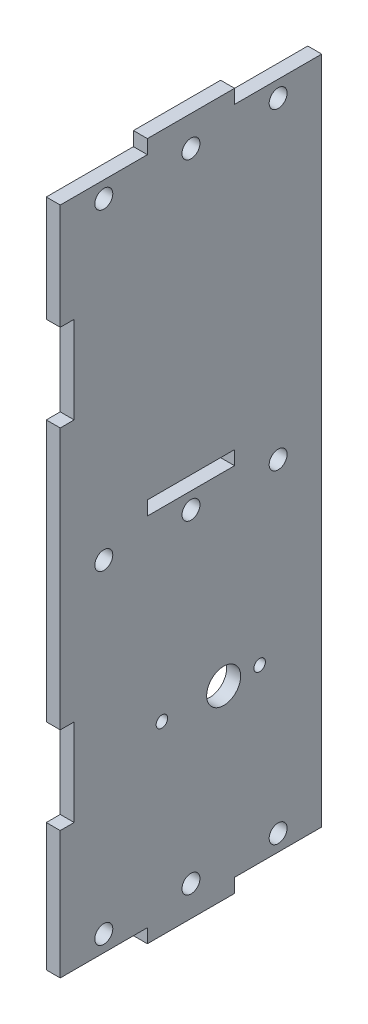
ISO-10303-21;
HEADER;
FILE_DESCRIPTION(('STEP AP214'),'2;1');
FILE_NAME('part.step','',(''),(''),'','','');
FILE_SCHEMA(('AUTOMOTIVE_DESIGN { 1 0 10303 214 1 1 1 1 }'));
ENDSEC;
DATA;
#1=APPLICATION_CONTEXT('core data for automotive mechanical design processes');
#2=APPLICATION_PROTOCOL_DEFINITION('international standard','automotive_design',2000,#1);
#3=PRODUCT_CONTEXT('',#1,'mechanical');
#4=PRODUCT('Part','Part','',(#3));
#5=PRODUCT_RELATED_PRODUCT_CATEGORY('part','',(#4));
#6=PRODUCT_DEFINITION_FORMATION('','',#4);
#7=PRODUCT_DEFINITION_CONTEXT('part definition',#1,'design');
#8=PRODUCT_DEFINITION('design','',#6,#7);
#9=PRODUCT_DEFINITION_SHAPE('','',#8);
#10=(LENGTH_UNIT() NAMED_UNIT(*) SI_UNIT(.MILLI.,.METRE.));
#11=(NAMED_UNIT(*) PLANE_ANGLE_UNIT() SI_UNIT($,.RADIAN.));
#12=(NAMED_UNIT(*) SI_UNIT($,.STERADIAN.) SOLID_ANGLE_UNIT());
#13=UNCERTAINTY_MEASURE_WITH_UNIT(LENGTH_MEASURE(1.E-05),#10,'distance_accuracy_value','');
#14=(GEOMETRIC_REPRESENTATION_CONTEXT(3) GLOBAL_UNCERTAINTY_ASSIGNED_CONTEXT((#13)) GLOBAL_UNIT_ASSIGNED_CONTEXT((#10,
#11,#12)) REPRESENTATION_CONTEXT('',''));
#15=CARTESIAN_POINT('',(0.,0.,0.));
#16=DIRECTION('',(0.,0.,1.));
#17=DIRECTION('',(1.,0.,0.));
#18=AXIS2_PLACEMENT_3D('',#15,#16,#17);
#19=CARTESIAN_POINT('',(0.,-60.3250000016129,0.));
#20=DIRECTION('',(0.,1.,0.));
#21=DIRECTION('',(0.,0.,1.));
#22=AXIS2_PLACEMENT_3D('',#19,#20,#21);
#23=PLANE('',#22);
#24=DIRECTION('',(0.,0.,-1.));
#25=VECTOR('',#24,1.);
#26=CARTESIAN_POINT('',(0.,-60.325,0.));
#27=LINE('',#26,#25);
#28=CARTESIAN_POINT('',(0.,-60.3250000004032,34.0359999994839));
#29=VERTEX_POINT('',#28);
#30=CARTESIAN_POINT('',(0.,-60.3250000004032,38.1));
#31=VERTEX_POINT('',#30);
#32=EDGE_CURVE('E338',#29,#31,#27,.F.);
#33=ORIENTED_EDGE('',*,*,#32,.T.);
#34=DIRECTION('',(1.,0.,0.));
#35=VECTOR('',#34,1.);
#36=CARTESIAN_POINT('',(0.,-60.325,38.1));
#37=LINE('',#36,#35);
#38=CARTESIAN_POINT('',(4.06399999993548,-60.3250000004032,38.1));
#39=VERTEX_POINT('',#38);
#40=EDGE_CURVE('E437',#31,#39,#37,.T.);
#41=ORIENTED_EDGE('',*,*,#40,.T.);
#42=DIRECTION('',(0.,0.,-1.));
#43=VECTOR('',#42,1.);
#44=CARTESIAN_POINT('',(4.06399999974193,-60.325,0.));
#45=LINE('',#44,#43);
#46=CARTESIAN_POINT('',(4.06399999993548,-60.3250000008064,34.0359999997419));
#47=VERTEX_POINT('',#46);
#48=EDGE_CURVE('E434',#39,#47,#45,.T.);
#49=ORIENTED_EDGE('',*,*,#48,.T.);
#50=DIRECTION('',(1.,0.,0.));
#51=VECTOR('',#50,1.);
#52=CARTESIAN_POINT('',(0.,-60.325,34.0359999989677));
#53=LINE('',#52,#51);
#54=EDGE_CURVE('E245',#47,#29,#53,.F.);
#55=ORIENTED_EDGE('',*,*,#54,.T.);
#56=EDGE_LOOP('',(#33,#41,#49,#55));
#57=FACE_BOUND('',#56,.T.);
#58=ADVANCED_FACE('F17',(#57),#23,.T.);
#59=CARTESIAN_POINT('',(0.,0.,34.0359999989677));
#60=DIRECTION('',(0.,0.,1.));
#61=DIRECTION('',(1.,0.,0.));
#62=AXIS2_PLACEMENT_3D('',#59,#60,#61);
#63=PLANE('',#62);
#64=DIRECTION('',(0.,1.,0.));
#65=VECTOR('',#64,1.);
#66=CARTESIAN_POINT('',(0.,0.,34.036));
#67=LINE('',#66,#65);
#68=CARTESIAN_POINT('',(0.,-34.9250000008065,34.0359999997419));
#69=VERTEX_POINT('',#68);
#70=EDGE_CURVE('E340',#69,#29,#67,.F.);
#71=ORIENTED_EDGE('',*,*,#70,.T.);
#72=ORIENTED_EDGE('',*,*,#54,.F.);
#73=DIRECTION('',(0.,1.,0.));
#74=VECTOR('',#73,1.);
#75=CARTESIAN_POINT('',(4.06399999974193,0.,34.036));
#76=LINE('',#75,#74);
#77=CARTESIAN_POINT('',(4.06399999993548,-34.9250000004032,34.0359999994839));
#78=VERTEX_POINT('',#77);
#79=EDGE_CURVE('E431',#47,#78,#76,.T.);
#80=ORIENTED_EDGE('',*,*,#79,.T.);
#81=DIRECTION('',(1.,0.,0.));
#82=VECTOR('',#81,1.);
#83=CARTESIAN_POINT('',(0.,-34.9250000016129,34.036));
#84=LINE('',#83,#82);
#85=EDGE_CURVE('E243',#78,#69,#84,.F.);
#86=ORIENTED_EDGE('',*,*,#85,.T.);
#87=EDGE_LOOP('',(#71,#72,#80,#86));
#88=FACE_BOUND('',#87,.T.);
#89=ADVANCED_FACE('F810',(#88),#63,.T.);
#90=CARTESIAN_POINT('',(0.,-34.9250000016129,0.));
#91=DIRECTION('',(0.,1.,0.));
#92=DIRECTION('',(0.,0.,1.));
#93=AXIS2_PLACEMENT_3D('',#90,#91,#92);
#94=PLANE('',#93);
#95=DIRECTION('',(1.,0.,0.));
#96=VECTOR('',#95,1.);
#97=CARTESIAN_POINT('',(0.,-34.925,38.1));
#98=LINE('',#97,#96);
#99=CARTESIAN_POINT('',(4.06399999993548,-34.9250000008065,38.1));
#100=VERTEX_POINT('',#99);
#101=CARTESIAN_POINT('',(0.,-34.9250000004032,38.1));
#102=VERTEX_POINT('',#101);
#103=EDGE_CURVE('E241',#100,#102,#98,.F.);
#104=ORIENTED_EDGE('',*,*,#103,.T.);
#105=DIRECTION('',(0.,0.,-1.));
#106=VECTOR('',#105,1.);
#107=CARTESIAN_POINT('',(0.,-34.925,0.));
#108=LINE('',#107,#106);
#109=EDGE_CURVE('E343',#102,#69,#108,.T.);
#110=ORIENTED_EDGE('',*,*,#109,.T.);
#111=ORIENTED_EDGE('',*,*,#85,.F.);
#112=DIRECTION('',(0.,0.,-1.));
#113=VECTOR('',#112,1.);
#114=CARTESIAN_POINT('',(4.06399999974193,-34.925,0.));
#115=LINE('',#114,#113);
#116=EDGE_CURVE('E428',#78,#100,#115,.F.);
#117=ORIENTED_EDGE('',*,*,#116,.T.);
#118=EDGE_LOOP('',(#104,#110,#111,#117));
#119=FACE_BOUND('',#118,.T.);
#120=ADVANCED_FACE('F801',(#119),#94,.F.);
#121=CARTESIAN_POINT('',(0.,0.,38.1));
#122=DIRECTION('',(0.,0.,1.));
#123=DIRECTION('',(1.,0.,0.));
#124=AXIS2_PLACEMENT_3D('',#121,#122,#123);
#125=PLANE('',#124);
#126=DIRECTION('',(1.,0.,0.));
#127=VECTOR('',#126,1.);
#128=CARTESIAN_POINT('',(0.,41.2749999983871,38.1));
#129=LINE('',#128,#127);
#130=CARTESIAN_POINT('',(4.06399999993548,41.2749999995968,38.1));
#131=VERTEX_POINT('',#130);
#132=CARTESIAN_POINT('',(0.,41.2749999991936,38.1));
#133=VERTEX_POINT('',#132);
#134=EDGE_CURVE('E239',#131,#133,#129,.F.);
#135=ORIENTED_EDGE('',*,*,#134,.T.);
#136=DIRECTION('',(0.,1.,0.));
#137=VECTOR('',#136,1.);
#138=CARTESIAN_POINT('',(0.,0.,38.1));
#139=LINE('',#138,#137);
#140=EDGE_CURVE('E346',#133,#102,#139,.F.);
#141=ORIENTED_EDGE('',*,*,#140,.T.);
#142=ORIENTED_EDGE('',*,*,#103,.F.);
#143=DIRECTION('',(0.,1.,0.));
#144=VECTOR('',#143,1.);
#145=CARTESIAN_POINT('',(4.06399999974193,0.,38.1));
#146=LINE('',#145,#144);
#147=EDGE_CURVE('E425',#100,#131,#146,.T.);
#148=ORIENTED_EDGE('',*,*,#147,.T.);
#149=EDGE_LOOP('',(#135,#141,#142,#148));
#150=FACE_BOUND('',#149,.T.);
#151=ADVANCED_FACE('F792',(#150),#125,.T.);
#152=CARTESIAN_POINT('',(0.,41.2749999983871,0.));
#153=DIRECTION('',(0.,1.,0.));
#154=DIRECTION('',(0.,0.,1.));
#155=AXIS2_PLACEMENT_3D('',#152,#153,#154);
#156=PLANE('',#155);
#157=DIRECTION('',(0.,0.,-1.));
#158=VECTOR('',#157,1.);
#159=CARTESIAN_POINT('',(0.,41.275,0.));
#160=LINE('',#159,#158);
#161=CARTESIAN_POINT('',(0.,41.2749999995968,34.0359999994839));
#162=VERTEX_POINT('',#161);
#163=EDGE_CURVE('E349',#162,#133,#160,.F.);
#164=ORIENTED_EDGE('',*,*,#163,.T.);
#165=ORIENTED_EDGE('',*,*,#134,.F.);
#166=DIRECTION('',(0.,0.,-1.));
#167=VECTOR('',#166,1.);
#168=CARTESIAN_POINT('',(4.06399999974193,41.275,0.));
#169=LINE('',#168,#167);
#170=CARTESIAN_POINT('',(4.06399999993548,41.2749999991936,34.0359999997419));
#171=VERTEX_POINT('',#170);
#172=EDGE_CURVE('E422',#131,#171,#169,.T.);
#173=ORIENTED_EDGE('',*,*,#172,.T.);
#174=DIRECTION('',(1.,0.,0.));
#175=VECTOR('',#174,1.);
#176=CARTESIAN_POINT('',(0.,41.275,34.0359999989677));
#177=LINE('',#176,#175);
#178=EDGE_CURVE('E237',#171,#162,#177,.F.);
#179=ORIENTED_EDGE('',*,*,#178,.T.);
#180=EDGE_LOOP('',(#164,#165,#173,#179));
#181=FACE_BOUND('',#180,.T.);
#182=ADVANCED_FACE('F783',(#181),#156,.T.);
#183=CARTESIAN_POINT('',(0.,0.,34.0359999989677));
#184=DIRECTION('',(0.,0.,1.));
#185=DIRECTION('',(1.,0.,0.));
#186=AXIS2_PLACEMENT_3D('',#183,#184,#185);
#187=PLANE('',#186);
#188=DIRECTION('',(0.,1.,0.));
#189=VECTOR('',#188,1.);
#190=CARTESIAN_POINT('',(0.,0.,34.036));
#191=LINE('',#190,#189);
#192=CARTESIAN_POINT('',(0.,66.6750000024194,34.0359999997419));
#193=VERTEX_POINT('',#192);
#194=EDGE_CURVE('E352',#193,#162,#191,.F.);
#195=ORIENTED_EDGE('',*,*,#194,.T.);
#196=ORIENTED_EDGE('',*,*,#178,.F.);
#197=DIRECTION('',(0.,1.,0.));
#198=VECTOR('',#197,1.);
#199=CARTESIAN_POINT('',(4.06399999974193,0.,34.036));
#200=LINE('',#199,#198);
#201=CARTESIAN_POINT('',(4.06399999993548,66.6750000012097,34.0359999994839));
#202=VERTEX_POINT('',#201);
#203=EDGE_CURVE('E419',#171,#202,#200,.T.);
#204=ORIENTED_EDGE('',*,*,#203,.T.);
#205=DIRECTION('',(1.,0.,0.));
#206=VECTOR('',#205,1.);
#207=CARTESIAN_POINT('',(0.,66.6750000048387,34.036));
#208=LINE('',#207,#206);
#209=EDGE_CURVE('E235',#202,#193,#208,.F.);
#210=ORIENTED_EDGE('',*,*,#209,.T.);
#211=EDGE_LOOP('',(#195,#196,#204,#210));
#212=FACE_BOUND('',#211,.T.);
#213=ADVANCED_FACE('F774',(#212),#187,.T.);
#214=CARTESIAN_POINT('',(0.,66.6750000048387,0.));
#215=DIRECTION('',(0.,1.,0.));
#216=DIRECTION('',(0.,0.,1.));
#217=AXIS2_PLACEMENT_3D('',#214,#215,#216);
#218=PLANE('',#217);
#219=DIRECTION('',(1.,0.,0.));
#220=VECTOR('',#219,1.);
#221=CARTESIAN_POINT('',(0.,66.675,38.1));
#222=LINE('',#221,#220);
#223=CARTESIAN_POINT('',(4.06399999993548,66.6750000024194,38.1));
#224=VERTEX_POINT('',#223);
#225=CARTESIAN_POINT('',(0.,66.6750000012097,38.1));
#226=VERTEX_POINT('',#225);
#227=EDGE_CURVE('E233',#224,#226,#222,.F.);
#228=ORIENTED_EDGE('',*,*,#227,.T.);
#229=DIRECTION('',(0.,0.,-1.));
#230=VECTOR('',#229,1.);
#231=CARTESIAN_POINT('',(0.,66.675,0.));
#232=LINE('',#231,#230);
#233=EDGE_CURVE('E355',#226,#193,#232,.T.);
#234=ORIENTED_EDGE('',*,*,#233,.T.);
#235=ORIENTED_EDGE('',*,*,#209,.F.);
#236=DIRECTION('',(0.,0.,-1.));
#237=VECTOR('',#236,1.);
#238=CARTESIAN_POINT('',(4.06399999974193,66.675,0.));
#239=LINE('',#238,#237);
#240=EDGE_CURVE('E416',#202,#224,#239,.F.);
#241=ORIENTED_EDGE('',*,*,#240,.T.);
#242=EDGE_LOOP('',(#228,#234,#235,#241));
#243=FACE_BOUND('',#242,.T.);
#244=ADVANCED_FACE('F765',(#243),#218,.F.);
#245=CARTESIAN_POINT('',(0.,0.,38.1));
#246=DIRECTION('',(0.,0.,1.));
#247=DIRECTION('',(1.,0.,0.));
#248=AXIS2_PLACEMENT_3D('',#245,#246,#247);
#249=PLANE('',#248);
#250=DIRECTION('',(1.,0.,0.));
#251=VECTOR('',#250,1.);
#252=CARTESIAN_POINT('',(0.,97.5360000247741,38.1));
#253=LINE('',#252,#251);
#254=CARTESIAN_POINT('',(4.06399999993548,97.5360000061935,38.1));
#255=VERTEX_POINT('',#254);
#256=CARTESIAN_POINT('',(0.,97.5360000123871,38.1));
#257=VERTEX_POINT('',#256);
#258=EDGE_CURVE('E231',#255,#257,#253,.F.);
#259=ORIENTED_EDGE('',*,*,#258,.T.);
#260=DIRECTION('',(0.,1.,0.));
#261=VECTOR('',#260,1.);
#262=CARTESIAN_POINT('',(0.,0.,38.1));
#263=LINE('',#262,#261);
#264=EDGE_CURVE('E358',#257,#226,#263,.F.);
#265=ORIENTED_EDGE('',*,*,#264,.T.);
#266=ORIENTED_EDGE('',*,*,#227,.F.);
#267=DIRECTION('',(0.,1.,0.));
#268=VECTOR('',#267,1.);
#269=CARTESIAN_POINT('',(4.06399999974193,0.,38.1));
#270=LINE('',#269,#268);
#271=EDGE_CURVE('E413',#224,#255,#270,.T.);
#272=ORIENTED_EDGE('',*,*,#271,.T.);
#273=EDGE_LOOP('',(#259,#265,#266,#272));
#274=FACE_BOUND('',#273,.T.);
#275=ADVANCED_FACE('F756',(#274),#249,.T.);
#276=CARTESIAN_POINT('',(0.,97.5360000247741,0.));
#277=DIRECTION('',(0.,1.,0.));
#278=DIRECTION('',(0.,0.,1.));
#279=AXIS2_PLACEMENT_3D('',#276,#277,#278);
#280=PLANE('',#279);
#281=DIRECTION('',(0.,0.,-1.));
#282=VECTOR('',#281,1.);
#283=CARTESIAN_POINT('',(0.,97.536,0.));
#284=LINE('',#283,#282);
#285=CARTESIAN_POINT('',(0.,97.5360000061935,12.7));
#286=VERTEX_POINT('',#285);
#287=EDGE_CURVE('E361',#286,#257,#284,.F.);
#288=ORIENTED_EDGE('',*,*,#287,.T.);
#289=ORIENTED_EDGE('',*,*,#258,.F.);
#290=DIRECTION('',(0.,0.,-1.));
#291=VECTOR('',#290,1.);
#292=CARTESIAN_POINT('',(4.06399999974193,97.536,0.));
#293=LINE('',#292,#291);
#294=CARTESIAN_POINT('',(4.06399999993548,97.5360000123871,12.7));
#295=VERTEX_POINT('',#294);
#296=EDGE_CURVE('E410',#255,#295,#293,.T.);
#297=ORIENTED_EDGE('',*,*,#296,.T.);
#298=DIRECTION('',(1.,0.,0.));
#299=VECTOR('',#298,1.);
#300=CARTESIAN_POINT('',(0.,97.536,12.7));
#301=LINE('',#300,#299);
#302=EDGE_CURVE('E229',#295,#286,#301,.F.);
#303=ORIENTED_EDGE('',*,*,#302,.T.);
#304=EDGE_LOOP('',(#288,#289,#297,#303));
#305=FACE_BOUND('',#304,.T.);
#306=ADVANCED_FACE('F747',(#305),#280,.T.);
#307=CARTESIAN_POINT('',(0.,0.,12.7));
#308=DIRECTION('',(0.,0.,1.));
#309=DIRECTION('',(1.,0.,0.));
#310=AXIS2_PLACEMENT_3D('',#307,#308,#309);
#311=PLANE('',#310);
#312=DIRECTION('',(0.,1.,0.));
#313=VECTOR('',#312,1.);
#314=CARTESIAN_POINT('',(0.,0.,12.7));
#315=LINE('',#314,#313);
#316=CARTESIAN_POINT('',(0.,101.600000012903,12.7));
#317=VERTEX_POINT('',#316);
#318=EDGE_CURVE('E364',#317,#286,#315,.F.);
#319=ORIENTED_EDGE('',*,*,#318,.T.);
#320=ORIENTED_EDGE('',*,*,#302,.F.);
#321=DIRECTION('',(0.,1.,0.));
#322=VECTOR('',#321,1.);
#323=CARTESIAN_POINT('',(4.06399999974193,0.,12.7));
#324=LINE('',#323,#322);
#325=CARTESIAN_POINT('',(4.06399999993548,101.600000006452,12.7));
#326=VERTEX_POINT('',#325);
#327=EDGE_CURVE('E407',#295,#326,#324,.T.);
#328=ORIENTED_EDGE('',*,*,#327,.T.);
#329=DIRECTION('',(1.,0.,0.));
#330=VECTOR('',#329,1.);
#331=CARTESIAN_POINT('',(0.,101.600000025806,12.7));
#332=LINE('',#331,#330);
#333=EDGE_CURVE('E227',#326,#317,#332,.F.);
#334=ORIENTED_EDGE('',*,*,#333,.T.);
#335=EDGE_LOOP('',(#319,#320,#328,#334));
#336=FACE_BOUND('',#335,.T.);
#337=ADVANCED_FACE('F738',(#336),#311,.T.);
#338=CARTESIAN_POINT('',(0.,101.600000025806,0.));
#339=DIRECTION('',(0.,1.,0.));
#340=DIRECTION('',(0.,0.,1.));
#341=AXIS2_PLACEMENT_3D('',#338,#339,#340);
#342=PLANE('',#341);
#343=DIRECTION('',(0.,0.,-1.));
#344=VECTOR('',#343,1.);
#345=CARTESIAN_POINT('',(0.,101.6,0.));
#346=LINE('',#345,#344);
#347=CARTESIAN_POINT('',(0.,101.600000006452,-12.7));
#348=VERTEX_POINT('',#347);
#349=EDGE_CURVE('E367',#348,#317,#346,.F.);
#350=ORIENTED_EDGE('',*,*,#349,.T.);
#351=ORIENTED_EDGE('',*,*,#333,.F.);
#352=DIRECTION('',(0.,0.,-1.));
#353=VECTOR('',#352,1.);
#354=CARTESIAN_POINT('',(4.06399999974193,101.6,0.));
#355=LINE('',#354,#353);
#356=CARTESIAN_POINT('',(4.06399999993548,101.600000012903,-12.7));
#357=VERTEX_POINT('',#356);
#358=EDGE_CURVE('E404',#326,#357,#355,.T.);
#359=ORIENTED_EDGE('',*,*,#358,.T.);
#360=DIRECTION('',(-1.,0.,0.));
#361=VECTOR('',#360,1.);
#362=CARTESIAN_POINT('',(0.,101.6,-12.7));
#363=LINE('',#362,#361);
#364=EDGE_CURVE('E225',#357,#348,#363,.T.);
#365=ORIENTED_EDGE('',*,*,#364,.T.);
#366=EDGE_LOOP('',(#350,#351,#359,#365));
#367=FACE_BOUND('',#366,.T.);
#368=ADVANCED_FACE('F729',(#367),#342,.T.);
#369=CARTESIAN_POINT('',(0.,0.,-12.7));
#370=DIRECTION('',(0.,0.,-1.));
#371=DIRECTION('',(-1.,0.,0.));
#372=AXIS2_PLACEMENT_3D('',#369,#370,#371);
#373=PLANE('',#372);
#374=DIRECTION('',(0.,1.,0.));
#375=VECTOR('',#374,1.);
#376=CARTESIAN_POINT('',(0.,0.,-12.7));
#377=LINE('',#376,#375);
#378=CARTESIAN_POINT('',(0.,97.5360000123871,-12.7));
#379=VERTEX_POINT('',#378);
#380=EDGE_CURVE('E370',#379,#348,#377,.T.);
#381=ORIENTED_EDGE('',*,*,#380,.T.);
#382=ORIENTED_EDGE('',*,*,#364,.F.);
#383=DIRECTION('',(0.,1.,0.));
#384=VECTOR('',#383,1.);
#385=CARTESIAN_POINT('',(4.06399999974193,0.,-12.7));
#386=LINE('',#385,#384);
#387=CARTESIAN_POINT('',(4.06399999993548,97.5360000061935,-12.7));
#388=VERTEX_POINT('',#387);
#389=EDGE_CURVE('E401',#357,#388,#386,.F.);
#390=ORIENTED_EDGE('',*,*,#389,.T.);
#391=DIRECTION('',(1.,0.,0.));
#392=VECTOR('',#391,1.);
#393=CARTESIAN_POINT('',(0.,97.5360000247741,-12.7));
#394=LINE('',#393,#392);
#395=EDGE_CURVE('E223',#388,#379,#394,.F.);
#396=ORIENTED_EDGE('',*,*,#395,.T.);
#397=EDGE_LOOP('',(#381,#382,#390,#396));
#398=FACE_BOUND('',#397,.T.);
#399=ADVANCED_FACE('F720',(#398),#373,.T.);
#400=CARTESIAN_POINT('',(0.,97.5360000247741,0.));
#401=DIRECTION('',(0.,1.,0.));
#402=DIRECTION('',(0.,0.,1.));
#403=AXIS2_PLACEMENT_3D('',#400,#401,#402);
#404=PLANE('',#403);
#405=DIRECTION('',(0.,0.,-1.));
#406=VECTOR('',#405,1.);
#407=CARTESIAN_POINT('',(0.,97.536,0.));
#408=LINE('',#407,#406);
#409=CARTESIAN_POINT('',(0.,97.5360000061935,-38.1));
#410=VERTEX_POINT('',#409);
#411=EDGE_CURVE('E373',#410,#379,#408,.F.);
#412=ORIENTED_EDGE('',*,*,#411,.T.);
#413=ORIENTED_EDGE('',*,*,#395,.F.);
#414=DIRECTION('',(0.,0.,-1.));
#415=VECTOR('',#414,1.);
#416=CARTESIAN_POINT('',(4.06399999974193,97.536,0.));
#417=LINE('',#416,#415);
#418=CARTESIAN_POINT('',(4.06399999993548,97.5360000123871,-38.1));
#419=VERTEX_POINT('',#418);
#420=EDGE_CURVE('E395',#388,#419,#417,.T.);
#421=ORIENTED_EDGE('',*,*,#420,.T.);
#422=DIRECTION('',(1.,0.,0.));
#423=VECTOR('',#422,1.);
#424=CARTESIAN_POINT('',(0.,97.536,-38.1));
#425=LINE('',#424,#423);
#426=EDGE_CURVE('E221',#419,#410,#425,.F.);
#427=ORIENTED_EDGE('',*,*,#426,.T.);
#428=EDGE_LOOP('',(#412,#413,#421,#427));
#429=FACE_BOUND('',#428,.T.);
#430=ADVANCED_FACE('F711',(#429),#404,.T.);
#431=CARTESIAN_POINT('',(0.,0.,-38.1));
#432=DIRECTION('',(0.,0.,1.));
#433=DIRECTION('',(1.,0.,0.));
#434=AXIS2_PLACEMENT_3D('',#431,#432,#433);
#435=PLANE('',#434);
#436=DIRECTION('',(1.,0.,0.));
#437=VECTOR('',#436,1.);
#438=CARTESIAN_POINT('',(0.,-97.5360000247741,-38.1));
#439=LINE('',#438,#437);
#440=CARTESIAN_POINT('',(4.06399999993548,-97.5360000061935,-38.1));
#441=VERTEX_POINT('',#440);
#442=CARTESIAN_POINT('',(0.,-97.5360000123871,-38.1));
#443=VERTEX_POINT('',#442);
#444=EDGE_CURVE('E219',#441,#443,#439,.F.);
#445=ORIENTED_EDGE('',*,*,#444,.T.);
#446=DIRECTION('',(0.,1.,0.));
#447=VECTOR('',#446,1.);
#448=CARTESIAN_POINT('',(0.,0.,-38.1));
#449=LINE('',#448,#447);
#450=EDGE_CURVE('E376',#443,#410,#449,.T.);
#451=ORIENTED_EDGE('',*,*,#450,.T.);
#452=ORIENTED_EDGE('',*,*,#426,.F.);
#453=DIRECTION('',(0.,1.,0.));
#454=VECTOR('',#453,1.);
#455=CARTESIAN_POINT('',(4.06399999974193,0.,-38.1));
#456=LINE('',#455,#454);
#457=EDGE_CURVE('E393',#419,#441,#456,.F.);
#458=ORIENTED_EDGE('',*,*,#457,.T.);
#459=EDGE_LOOP('',(#445,#451,#452,#458));
#460=FACE_BOUND('',#459,.T.);
#461=ADVANCED_FACE('F703',(#460),#435,.F.);
#462=CARTESIAN_POINT('',(0.,-97.5360000247741,0.));
#463=DIRECTION('',(0.,1.,0.));
#464=DIRECTION('',(0.,0.,1.));
#465=AXIS2_PLACEMENT_3D('',#462,#463,#464);
#466=PLANE('',#465);
#467=DIRECTION('',(-1.,0.,0.));
#468=VECTOR('',#467,1.);
#469=CARTESIAN_POINT('',(0.,-97.536,-12.7));
#470=LINE('',#469,#468);
#471=CARTESIAN_POINT('',(4.06399999993548,-97.5360000123871,-12.7));
#472=VERTEX_POINT('',#471);
#473=CARTESIAN_POINT('',(0.,-97.5360000061935,-12.7));
#474=VERTEX_POINT('',#473);
#475=EDGE_CURVE('E217',#472,#474,#470,.T.);
#476=ORIENTED_EDGE('',*,*,#475,.T.);
#477=DIRECTION('',(0.,0.,-1.));
#478=VECTOR('',#477,1.);
#479=CARTESIAN_POINT('',(0.,-97.536,0.));
#480=LINE('',#479,#478);
#481=EDGE_CURVE('E379',#474,#443,#480,.T.);
#482=ORIENTED_EDGE('',*,*,#481,.T.);
#483=ORIENTED_EDGE('',*,*,#444,.F.);
#484=DIRECTION('',(0.,0.,-1.));
#485=VECTOR('',#484,1.);
#486=CARTESIAN_POINT('',(4.06399999974193,-97.536,0.));
#487=LINE('',#486,#485);
#488=EDGE_CURVE('E389',#441,#472,#487,.F.);
#489=ORIENTED_EDGE('',*,*,#488,.T.);
#490=EDGE_LOOP('',(#476,#482,#483,#489));
#491=FACE_BOUND('',#490,.T.);
#492=ADVANCED_FACE('F392',(#491),#466,.F.);
#493=CARTESIAN_POINT('',(0.,0.,-12.7));
#494=DIRECTION('',(0.,0.,-1.));
#495=DIRECTION('',(-1.,0.,0.));
#496=AXIS2_PLACEMENT_3D('',#493,#494,#495);
#497=PLANE('',#496);
#498=DIRECTION('',(1.,0.,0.));
#499=VECTOR('',#498,1.);
#500=CARTESIAN_POINT('',(0.,-101.600000025806,-12.7));
#501=LINE('',#500,#499);
#502=CARTESIAN_POINT('',(4.06399999993548,-101.600000006452,-12.7));
#503=VERTEX_POINT('',#502);
#504=CARTESIAN_POINT('',(0.,-101.600000012903,-12.7));
#505=VERTEX_POINT('',#504);
#506=EDGE_CURVE('E175',#503,#505,#501,.F.);
#507=ORIENTED_EDGE('',*,*,#506,.T.);
#508=DIRECTION('',(0.,1.,0.));
#509=VECTOR('',#508,1.);
#510=CARTESIAN_POINT('',(0.,0.,-12.7));
#511=LINE('',#510,#509);
#512=EDGE_CURVE('E200',#505,#474,#511,.T.);
#513=ORIENTED_EDGE('',*,*,#512,.T.);
#514=ORIENTED_EDGE('',*,*,#475,.F.);
#515=DIRECTION('',(0.,1.,0.));
#516=VECTOR('',#515,1.);
#517=CARTESIAN_POINT('',(4.06399999974193,0.,-12.7));
#518=LINE('',#517,#516);
#519=EDGE_CURVE('E383',#472,#503,#518,.F.);
#520=ORIENTED_EDGE('',*,*,#519,.T.);
#521=EDGE_LOOP('',(#507,#513,#514,#520));
#522=FACE_BOUND('',#521,.T.);
#523=ADVANCED_FACE('F381',(#522),#497,.T.);
#524=CARTESIAN_POINT('',(0.,-101.600000025806,0.));
#525=DIRECTION('',(0.,1.,0.));
#526=DIRECTION('',(0.,0.,1.));
#527=AXIS2_PLACEMENT_3D('',#524,#525,#526);
#528=PLANE('',#527);
#529=DIRECTION('',(1.,0.,0.));
#530=VECTOR('',#529,1.);
#531=CARTESIAN_POINT('',(0.,-101.6,12.7));
#532=LINE('',#531,#530);
#533=CARTESIAN_POINT('',(4.06399999993548,-101.600000012903,12.7));
#534=VERTEX_POINT('',#533);
#535=CARTESIAN_POINT('',(0.,-101.600000006452,12.7));
#536=VERTEX_POINT('',#535);
#537=EDGE_CURVE('E181',#534,#536,#532,.F.);
#538=ORIENTED_EDGE('',*,*,#537,.T.);
#539=DIRECTION('',(0.,0.,-1.));
#540=VECTOR('',#539,1.);
#541=CARTESIAN_POINT('',(0.,-101.6,0.));
#542=LINE('',#541,#540);
#543=EDGE_CURVE('E184',#536,#505,#542,.T.);
#544=ORIENTED_EDGE('',*,*,#543,.T.);
#545=ORIENTED_EDGE('',*,*,#506,.F.);
#546=DIRECTION('',(0.,0.,-1.));
#547=VECTOR('',#546,1.);
#548=CARTESIAN_POINT('',(4.06399999974193,-101.6,0.));
#549=LINE('',#548,#547);
#550=EDGE_CURVE('E186',#503,#534,#549,.F.);
#551=ORIENTED_EDGE('',*,*,#550,.T.);
#552=EDGE_LOOP('',(#538,#544,#545,#551));
#553=FACE_BOUND('',#552,.T.);
#554=ADVANCED_FACE('F183',(#553),#528,.F.);
#555=CARTESIAN_POINT('',(0.,0.,12.7));
#556=DIRECTION('',(0.,0.,1.));
#557=DIRECTION('',(1.,0.,0.));
#558=AXIS2_PLACEMENT_3D('',#555,#556,#557);
#559=PLANE('',#558);
#560=DIRECTION('',(1.,0.,0.));
#561=VECTOR('',#560,1.);
#562=CARTESIAN_POINT('',(0.,6.35,12.7));
#563=LINE('',#562,#561);
#564=CARTESIAN_POINT('',(4.06399999993548,6.35,12.7));
#565=VERTEX_POINT('',#564);
#566=CARTESIAN_POINT('',(0.,6.35,12.7));
#567=VERTEX_POINT('',#566);
#568=EDGE_CURVE('E214',#565,#567,#563,.F.);
#569=ORIENTED_EDGE('',*,*,#568,.T.);
#570=DIRECTION('',(0.,1.,0.));
#571=VECTOR('',#570,1.);
#572=CARTESIAN_POINT('',(0.,0.,12.7));
#573=LINE('',#572,#571);
#574=CARTESIAN_POINT('',(0.,10.4139999989032,12.7));
#575=VERTEX_POINT('',#574);
#576=EDGE_CURVE('E319',#567,#575,#573,.T.);
#577=ORIENTED_EDGE('',*,*,#576,.T.);
#578=DIRECTION('',(1.,0.,0.));
#579=VECTOR('',#578,1.);
#580=CARTESIAN_POINT('',(0.,10.4139999978065,12.7));
#581=LINE('',#580,#579);
#582=CARTESIAN_POINT('',(4.06399999993548,10.4139999994516,12.7));
#583=VERTEX_POINT('',#582);
#584=EDGE_CURVE('E192',#575,#583,#581,.T.);
#585=ORIENTED_EDGE('',*,*,#584,.T.);
#586=DIRECTION('',(0.,1.,0.));
#587=VECTOR('',#586,1.);
#588=CARTESIAN_POINT('',(4.06399999974193,0.,12.7));
#589=LINE('',#588,#587);
#590=EDGE_CURVE('E461',#583,#565,#589,.F.);
#591=ORIENTED_EDGE('',*,*,#590,.T.);
#592=EDGE_LOOP('',(#569,#577,#585,#591));
#593=FACE_BOUND('',#592,.T.);
#594=ADVANCED_FACE('F465',(#593),#559,.F.);
#595=CARTESIAN_POINT('',(0.,6.35,0.));
#596=DIRECTION('',(0.,-1.,0.));
#597=DIRECTION('',(0.,0.,-1.));
#598=AXIS2_PLACEMENT_3D('',#595,#596,#597);
#599=PLANE('',#598);
#600=DIRECTION('',(-1.,0.,0.));
#601=VECTOR('',#600,1.);
#602=CARTESIAN_POINT('',(0.,6.35,-12.7));
#603=LINE('',#602,#601);
#604=CARTESIAN_POINT('',(4.06399999993548,6.35,-12.7));
#605=VERTEX_POINT('',#604);
#606=CARTESIAN_POINT('',(0.,6.35,-12.7));
#607=VERTEX_POINT('',#606);
#608=EDGE_CURVE('E212',#605,#607,#603,.T.);
#609=ORIENTED_EDGE('',*,*,#608,.T.);
#610=DIRECTION('',(0.,0.,-1.));
#611=VECTOR('',#610,1.);
#612=CARTESIAN_POINT('',(0.,6.35,0.));
#613=LINE('',#612,#611);
#614=EDGE_CURVE('E323',#607,#567,#613,.F.);
#615=ORIENTED_EDGE('',*,*,#614,.T.);
#616=ORIENTED_EDGE('',*,*,#568,.F.);
#617=DIRECTION('',(0.,0.,-1.));
#618=VECTOR('',#617,1.);
#619=CARTESIAN_POINT('',(4.06399999974193,6.35,0.));
#620=LINE('',#619,#618);
#621=EDGE_CURVE('E458',#565,#605,#620,.T.);
#622=ORIENTED_EDGE('',*,*,#621,.T.);
#623=EDGE_LOOP('',(#609,#615,#616,#622));
#624=FACE_BOUND('',#623,.T.);
#625=ADVANCED_FACE('F471',(#624),#599,.F.);
#626=CARTESIAN_POINT('',(0.,0.,-12.7));
#627=DIRECTION('',(0.,0.,-1.));
#628=DIRECTION('',(-1.,0.,0.));
#629=AXIS2_PLACEMENT_3D('',#626,#627,#628);
#630=PLANE('',#629);
#631=DIRECTION('',(0.,1.,0.));
#632=VECTOR('',#631,1.);
#633=CARTESIAN_POINT('',(0.,0.,-12.7));
#634=LINE('',#633,#632);
#635=CARTESIAN_POINT('',(0.,10.4139999989032,-12.7));
#636=VERTEX_POINT('',#635);
#637=EDGE_CURVE('E328',#636,#607,#634,.F.);
#638=ORIENTED_EDGE('',*,*,#637,.T.);
#639=ORIENTED_EDGE('',*,*,#608,.F.);
#640=DIRECTION('',(0.,1.,0.));
#641=VECTOR('',#640,1.);
#642=CARTESIAN_POINT('',(4.06399999974193,0.,-12.7));
#643=LINE('',#642,#641);
#644=CARTESIAN_POINT('',(4.06399999993548,10.4139999994516,-12.7));
#645=VERTEX_POINT('',#644);
#646=EDGE_CURVE('E455',#605,#645,#643,.T.);
#647=ORIENTED_EDGE('',*,*,#646,.T.);
#648=DIRECTION('',(1.,0.,0.));
#649=VECTOR('',#648,1.);
#650=CARTESIAN_POINT('',(0.,10.4139999978065,-12.7));
#651=LINE('',#650,#649);
#652=EDGE_CURVE('E210',#645,#636,#651,.F.);
#653=ORIENTED_EDGE('',*,*,#652,.T.);
#654=EDGE_LOOP('',(#638,#639,#647,#653));
#655=FACE_BOUND('',#654,.T.);
#656=ADVANCED_FACE('F477',(#655),#630,.F.);
#657=CARTESIAN_POINT('',(0.,10.4139999978065,0.));
#658=DIRECTION('',(0.,1.,0.));
#659=DIRECTION('',(0.,0.,1.));
#660=AXIS2_PLACEMENT_3D('',#657,#658,#659);
#661=PLANE('',#660);
#662=ORIENTED_EDGE('',*,*,#584,.F.);
#663=DIRECTION('',(0.,0.,-1.));
#664=VECTOR('',#663,1.);
#665=CARTESIAN_POINT('',(0.,10.414,0.));
#666=LINE('',#665,#664);
#667=EDGE_CURVE('E335',#575,#636,#666,.T.);
#668=ORIENTED_EDGE('',*,*,#667,.T.);
#669=ORIENTED_EDGE('',*,*,#652,.F.);
#670=DIRECTION('',(0.,0.,-1.));
#671=VECTOR('',#670,1.);
#672=CARTESIAN_POINT('',(4.06399999974193,10.414,0.));
#673=LINE('',#672,#671);
#674=EDGE_CURVE('E283',#645,#583,#673,.F.);
#675=ORIENTED_EDGE('',*,*,#674,.T.);
#676=EDGE_LOOP('',(#662,#668,#669,#675));
#677=FACE_BOUND('',#676,.T.);
#678=ADVANCED_FACE('F479',(#677),#661,.F.);
#679=CARTESIAN_POINT('',(4.064,-47.625,-9.525));
#680=DIRECTION('',(-1.,0.,0.));
#681=DIRECTION('',(0.,0.,1.));
#682=AXIS2_PLACEMENT_3D('',#679,#680,#681);
#683=CYLINDRICAL_SURFACE('',#682,4.95299999999999);
#684=CARTESIAN_POINT('',(0.,-47.625,-9.525));
#685=DIRECTION('',(-1.,0.,0.));
#686=DIRECTION('',(0.,0.,1.));
#687=AXIS2_PLACEMENT_3D('',#684,#685,#686);
#688=CIRCLE('',#687,4.953);
#689=CARTESIAN_POINT('',(0.,-47.625,-4.572));
#690=VERTEX_POINT('',#689);
#691=EDGE_CURVE('E20',#690,#690,#688,.T.);
#692=ORIENTED_EDGE('',*,*,#691,.T.);
#693=EDGE_LOOP('',(#692));
#694=FACE_BOUND('',#693,.T.);
#695=CARTESIAN_POINT('',(4.064,-47.625,-9.525));
#696=DIRECTION('',(-1.,0.,0.));
#697=DIRECTION('',(0.,0.,1.));
#698=AXIS2_PLACEMENT_3D('',#695,#696,#697);
#699=CIRCLE('',#698,4.95299999999999);
#700=CARTESIAN_POINT('',(4.064,-47.625,-4.57200000000001));
#701=VERTEX_POINT('',#700);
#702=EDGE_CURVE('E280',#701,#701,#699,.F.);
#703=ORIENTED_EDGE('',*,*,#702,.T.);
#704=EDGE_LOOP('',(#703));
#705=FACE_BOUND('',#704,.T.);
#706=ADVANCED_FACE('F481',(#694,#705),#683,.F.);
#707=CARTESIAN_POINT('',(4.064,-47.625,8.4836));
#708=DIRECTION('',(-1.,0.,0.));
#709=DIRECTION('',(0.,0.,1.));
#710=AXIS2_PLACEMENT_3D('',#707,#708,#709);
#711=CYLINDRICAL_SURFACE('',#710,1.67639999999999);
#712=CARTESIAN_POINT('',(0.,-47.625,8.4836));
#713=DIRECTION('',(-1.,0.,0.));
#714=DIRECTION('',(0.,0.,1.));
#715=AXIS2_PLACEMENT_3D('',#712,#713,#714);
#716=CIRCLE('',#715,1.6764);
#717=CARTESIAN_POINT('',(0.,-47.625,10.16));
#718=VERTEX_POINT('',#717);
#719=EDGE_CURVE('E314',#718,#718,#716,.T.);
#720=ORIENTED_EDGE('',*,*,#719,.T.);
#721=EDGE_LOOP('',(#720));
#722=FACE_BOUND('',#721,.T.);
#723=CARTESIAN_POINT('',(4.064,-47.625,8.4836));
#724=DIRECTION('',(-1.,0.,0.));
#725=DIRECTION('',(0.,0.,1.));
#726=AXIS2_PLACEMENT_3D('',#723,#724,#725);
#727=CIRCLE('',#726,1.67639999999999);
#728=CARTESIAN_POINT('',(4.064,-47.625,10.16));
#729=VERTEX_POINT('',#728);
#730=EDGE_CURVE('E277',#729,#729,#727,.F.);
#731=ORIENTED_EDGE('',*,*,#730,.T.);
#732=EDGE_LOOP('',(#731));
#733=FACE_BOUND('',#732,.T.);
#734=ADVANCED_FACE('F488',(#722,#733),#711,.F.);
#735=CARTESIAN_POINT('',(4.064,-47.625,-20.0152));
#736=DIRECTION('',(-1.,0.,0.));
#737=DIRECTION('',(0.,0.,1.));
#738=AXIS2_PLACEMENT_3D('',#735,#736,#737);
#739=CYLINDRICAL_SURFACE('',#738,1.67639999999999);
#740=CARTESIAN_POINT('',(0.,-47.625,-20.0152));
#741=DIRECTION('',(-1.,0.,0.));
#742=DIRECTION('',(0.,0.,1.));
#743=AXIS2_PLACEMENT_3D('',#740,#741,#742);
#744=CIRCLE('',#743,1.6764);
#745=CARTESIAN_POINT('',(0.,-47.625,-18.3388));
#746=VERTEX_POINT('',#745);
#747=EDGE_CURVE('E312',#746,#746,#744,.T.);
#748=ORIENTED_EDGE('',*,*,#747,.T.);
#749=EDGE_LOOP('',(#748));
#750=FACE_BOUND('',#749,.T.);
#751=CARTESIAN_POINT('',(4.064,-47.625,-20.0152));
#752=DIRECTION('',(-1.,0.,0.));
#753=DIRECTION('',(0.,0.,1.));
#754=AXIS2_PLACEMENT_3D('',#751,#752,#753);
#755=CIRCLE('',#754,1.67639999999999);
#756=CARTESIAN_POINT('',(4.064,-47.625,-18.3388));
#757=VERTEX_POINT('',#756);
#758=EDGE_CURVE('E274',#757,#757,#755,.F.);
#759=ORIENTED_EDGE('',*,*,#758,.T.);
#760=EDGE_LOOP('',(#759));
#761=FACE_BOUND('',#760,.T.);
#762=ADVANCED_FACE('F541',(#750,#761),#739,.F.);
#763=CARTESIAN_POINT('',(0.,92.7608,-25.4));
#764=DIRECTION('',(1.,0.,0.));
#765=DIRECTION('',(0.,0.,-1.));
#766=AXIS2_PLACEMENT_3D('',#763,#764,#765);
#767=CYLINDRICAL_SURFACE('',#766,2.6162);
#768=CARTESIAN_POINT('',(4.064,92.7608,-25.4));
#769=DIRECTION('',(1.,0.,0.));
#770=DIRECTION('',(0.,0.,-1.));
#771=AXIS2_PLACEMENT_3D('',#768,#769,#770);
#772=CIRCLE('',#771,2.6162);
#773=CARTESIAN_POINT('',(4.064,92.7608,-28.0162));
#774=VERTEX_POINT('',#773);
#775=EDGE_CURVE('E271',#774,#774,#772,.T.);
#776=ORIENTED_EDGE('',*,*,#775,.T.);
#777=EDGE_LOOP('',(#776));
#778=FACE_BOUND('',#777,.T.);
#779=CARTESIAN_POINT('',(0.,92.7608,-25.4));
#780=DIRECTION('',(1.,0.,0.));
#781=DIRECTION('',(0.,0.,-1.));
#782=AXIS2_PLACEMENT_3D('',#779,#780,#781);
#783=CIRCLE('',#782,2.6162);
#784=CARTESIAN_POINT('',(0.,92.7608,-28.0162));
#785=VERTEX_POINT('',#784);
#786=EDGE_CURVE('E309',#785,#785,#783,.F.);
#787=ORIENTED_EDGE('',*,*,#786,.T.);
#788=EDGE_LOOP('',(#787));
#789=FACE_BOUND('',#788,.T.);
#790=ADVANCED_FACE('F537',(#778,#789),#767,.F.);
#791=CARTESIAN_POINT('',(0.,1.5748,-25.4));
#792=DIRECTION('',(1.,0.,0.));
#793=DIRECTION('',(0.,0.,-1.));
#794=AXIS2_PLACEMENT_3D('',#791,#792,#793);
#795=CYLINDRICAL_SURFACE('',#794,2.6162);
#796=CARTESIAN_POINT('',(4.064,1.5748,-25.4));
#797=DIRECTION('',(1.,0.,0.));
#798=DIRECTION('',(0.,0.,-1.));
#799=AXIS2_PLACEMENT_3D('',#796,#797,#798);
#800=CIRCLE('',#799,2.6162);
#801=CARTESIAN_POINT('',(4.064,1.5748,-28.0162));
#802=VERTEX_POINT('',#801);
#803=EDGE_CURVE('E268',#802,#802,#800,.T.);
#804=ORIENTED_EDGE('',*,*,#803,.T.);
#805=EDGE_LOOP('',(#804));
#806=FACE_BOUND('',#805,.T.);
#807=CARTESIAN_POINT('',(0.,1.5748,-25.4));
#808=DIRECTION('',(1.,0.,0.));
#809=DIRECTION('',(0.,0.,-1.));
#810=AXIS2_PLACEMENT_3D('',#807,#808,#809);
#811=CIRCLE('',#810,2.6162);
#812=CARTESIAN_POINT('',(0.,1.5748,-28.0162));
#813=VERTEX_POINT('',#812);
#814=EDGE_CURVE('E306',#813,#813,#811,.F.);
#815=ORIENTED_EDGE('',*,*,#814,.T.);
#816=EDGE_LOOP('',(#815));
#817=FACE_BOUND('',#816,.T.);
#818=ADVANCED_FACE('F533',(#806,#817),#795,.F.);
#819=CARTESIAN_POINT('',(0.,-92.7608,-25.4));
#820=DIRECTION('',(1.,0.,0.));
#821=DIRECTION('',(0.,0.,-1.));
#822=AXIS2_PLACEMENT_3D('',#819,#820,#821);
#823=CYLINDRICAL_SURFACE('',#822,2.6162);
#824=CARTESIAN_POINT('',(4.064,-92.7608,-25.4));
#825=DIRECTION('',(1.,0.,0.));
#826=DIRECTION('',(0.,0.,-1.));
#827=AXIS2_PLACEMENT_3D('',#824,#825,#826);
#828=CIRCLE('',#827,2.6162);
#829=CARTESIAN_POINT('',(4.064,-92.7608,-28.0162));
#830=VERTEX_POINT('',#829);
#831=EDGE_CURVE('E265',#830,#830,#828,.T.);
#832=ORIENTED_EDGE('',*,*,#831,.T.);
#833=EDGE_LOOP('',(#832));
#834=FACE_BOUND('',#833,.T.);
#835=CARTESIAN_POINT('',(0.,-92.7608,-25.4));
#836=DIRECTION('',(1.,0.,0.));
#837=DIRECTION('',(0.,0.,-1.));
#838=AXIS2_PLACEMENT_3D('',#835,#836,#837);
#839=CIRCLE('',#838,2.6162);
#840=CARTESIAN_POINT('',(0.,-92.7608,-28.0162));
#841=VERTEX_POINT('',#840);
#842=EDGE_CURVE('E303',#841,#841,#839,.F.);
#843=ORIENTED_EDGE('',*,*,#842,.T.);
#844=EDGE_LOOP('',(#843));
#845=FACE_BOUND('',#844,.T.);
#846=ADVANCED_FACE('F529',(#834,#845),#823,.F.);
#847=CARTESIAN_POINT('',(0.,92.7608,0.));
#848=DIRECTION('',(1.,0.,0.));
#849=DIRECTION('',(0.,0.,-1.));
#850=AXIS2_PLACEMENT_3D('',#847,#848,#849);
#851=CYLINDRICAL_SURFACE('',#850,2.6162);
#852=CARTESIAN_POINT('',(4.064,92.7608,0.));
#853=DIRECTION('',(1.,0.,0.));
#854=DIRECTION('',(0.,0.,-1.));
#855=AXIS2_PLACEMENT_3D('',#852,#853,#854);
#856=CIRCLE('',#855,2.6162);
#857=CARTESIAN_POINT('',(4.064,92.7608,-2.6162));
#858=VERTEX_POINT('',#857);
#859=EDGE_CURVE('E262',#858,#858,#856,.T.);
#860=ORIENTED_EDGE('',*,*,#859,.T.);
#861=EDGE_LOOP('',(#860));
#862=FACE_BOUND('',#861,.T.);
#863=CARTESIAN_POINT('',(0.,92.7608,0.));
#864=DIRECTION('',(1.,0.,0.));
#865=DIRECTION('',(0.,0.,-1.));
#866=AXIS2_PLACEMENT_3D('',#863,#864,#865);
#867=CIRCLE('',#866,2.6162);
#868=CARTESIAN_POINT('',(0.,92.7608,-2.6162));
#869=VERTEX_POINT('',#868);
#870=EDGE_CURVE('E300',#869,#869,#867,.F.);
#871=ORIENTED_EDGE('',*,*,#870,.T.);
#872=EDGE_LOOP('',(#871));
#873=FACE_BOUND('',#872,.T.);
#874=ADVANCED_FACE('F525',(#862,#873),#851,.F.);
#875=CARTESIAN_POINT('',(0.,-92.7608,0.));
#876=DIRECTION('',(1.,0.,0.));
#877=DIRECTION('',(0.,0.,-1.));
#878=AXIS2_PLACEMENT_3D('',#875,#876,#877);
#879=CYLINDRICAL_SURFACE('',#878,2.6162);
#880=CARTESIAN_POINT('',(4.064,-92.7608,0.));
#881=DIRECTION('',(1.,0.,0.));
#882=DIRECTION('',(0.,0.,-1.));
#883=AXIS2_PLACEMENT_3D('',#880,#881,#882);
#884=CIRCLE('',#883,2.6162);
#885=CARTESIAN_POINT('',(4.064,-92.7608,-2.6162));
#886=VERTEX_POINT('',#885);
#887=EDGE_CURVE('E259',#886,#886,#884,.T.);
#888=ORIENTED_EDGE('',*,*,#887,.T.);
#889=EDGE_LOOP('',(#888));
#890=FACE_BOUND('',#889,.T.);
#891=CARTESIAN_POINT('',(0.,-92.7608,0.));
#892=DIRECTION('',(1.,0.,0.));
#893=DIRECTION('',(0.,0.,-1.));
#894=AXIS2_PLACEMENT_3D('',#891,#892,#893);
#895=CIRCLE('',#894,2.6162);
#896=CARTESIAN_POINT('',(0.,-92.7608,-2.6162));
#897=VERTEX_POINT('',#896);
#898=EDGE_CURVE('E297',#897,#897,#895,.F.);
#899=ORIENTED_EDGE('',*,*,#898,.T.);
#900=EDGE_LOOP('',(#899));
#901=FACE_BOUND('',#900,.T.);
#902=ADVANCED_FACE('F521',(#890,#901),#879,.F.);
#903=CARTESIAN_POINT('',(0.,1.5748,0.));
#904=DIRECTION('',(1.,0.,0.));
#905=DIRECTION('',(0.,0.,-1.));
#906=AXIS2_PLACEMENT_3D('',#903,#904,#905);
#907=CYLINDRICAL_SURFACE('',#906,2.6162);
#908=CARTESIAN_POINT('',(4.064,1.5748,0.));
#909=DIRECTION('',(1.,0.,0.));
#910=DIRECTION('',(0.,0.,-1.));
#911=AXIS2_PLACEMENT_3D('',#908,#909,#910);
#912=CIRCLE('',#911,2.6162);
#913=CARTESIAN_POINT('',(4.064,1.5748,-2.6162));
#914=VERTEX_POINT('',#913);
#915=EDGE_CURVE('E256',#914,#914,#912,.T.);
#916=ORIENTED_EDGE('',*,*,#915,.T.);
#917=EDGE_LOOP('',(#916));
#918=FACE_BOUND('',#917,.T.);
#919=CARTESIAN_POINT('',(0.,1.5748,0.));
#920=DIRECTION('',(1.,0.,0.));
#921=DIRECTION('',(0.,0.,-1.));
#922=AXIS2_PLACEMENT_3D('',#919,#920,#921);
#923=CIRCLE('',#922,2.6162);
#924=CARTESIAN_POINT('',(0.,1.5748,-2.6162));
#925=VERTEX_POINT('',#924);
#926=EDGE_CURVE('E294',#925,#925,#923,.F.);
#927=ORIENTED_EDGE('',*,*,#926,.T.);
#928=EDGE_LOOP('',(#927));
#929=FACE_BOUND('',#928,.T.);
#930=ADVANCED_FACE('F517',(#918,#929),#907,.F.);
#931=CARTESIAN_POINT('',(0.,92.7608,25.4));
#932=DIRECTION('',(1.,0.,0.));
#933=DIRECTION('',(0.,0.,-1.));
#934=AXIS2_PLACEMENT_3D('',#931,#932,#933);
#935=CYLINDRICAL_SURFACE('',#934,2.6162);
#936=CARTESIAN_POINT('',(4.064,92.7608,25.4));
#937=DIRECTION('',(1.,0.,0.));
#938=DIRECTION('',(0.,0.,-1.));
#939=AXIS2_PLACEMENT_3D('',#936,#937,#938);
#940=CIRCLE('',#939,2.6162);
#941=CARTESIAN_POINT('',(4.064,92.7608,22.7838));
#942=VERTEX_POINT('',#941);
#943=EDGE_CURVE('E253',#942,#942,#940,.T.);
#944=ORIENTED_EDGE('',*,*,#943,.T.);
#945=EDGE_LOOP('',(#944));
#946=FACE_BOUND('',#945,.T.);
#947=CARTESIAN_POINT('',(0.,92.7608,25.4));
#948=DIRECTION('',(1.,0.,0.));
#949=DIRECTION('',(0.,0.,-1.));
#950=AXIS2_PLACEMENT_3D('',#947,#948,#949);
#951=CIRCLE('',#950,2.6162);
#952=CARTESIAN_POINT('',(0.,92.7608,22.7838));
#953=VERTEX_POINT('',#952);
#954=EDGE_CURVE('E291',#953,#953,#951,.F.);
#955=ORIENTED_EDGE('',*,*,#954,.T.);
#956=EDGE_LOOP('',(#955));
#957=FACE_BOUND('',#956,.T.);
#958=ADVANCED_FACE('F513',(#946,#957),#935,.F.);
#959=CARTESIAN_POINT('',(0.,-92.7608,25.4));
#960=DIRECTION('',(1.,0.,0.));
#961=DIRECTION('',(0.,0.,-1.));
#962=AXIS2_PLACEMENT_3D('',#959,#960,#961);
#963=CYLINDRICAL_SURFACE('',#962,2.6162);
#964=CARTESIAN_POINT('',(4.064,-92.7608,25.4));
#965=DIRECTION('',(1.,0.,0.));
#966=DIRECTION('',(0.,0.,-1.));
#967=AXIS2_PLACEMENT_3D('',#964,#965,#966);
#968=CIRCLE('',#967,2.6162);
#969=CARTESIAN_POINT('',(4.064,-92.7608,22.7838));
#970=VERTEX_POINT('',#969);
#971=EDGE_CURVE('E250',#970,#970,#968,.T.);
#972=ORIENTED_EDGE('',*,*,#971,.T.);
#973=EDGE_LOOP('',(#972));
#974=FACE_BOUND('',#973,.T.);
#975=CARTESIAN_POINT('',(0.,-92.7608,25.4));
#976=DIRECTION('',(1.,0.,0.));
#977=DIRECTION('',(0.,0.,-1.));
#978=AXIS2_PLACEMENT_3D('',#975,#976,#977);
#979=CIRCLE('',#978,2.6162);
#980=CARTESIAN_POINT('',(0.,-92.7608,22.7838));
#981=VERTEX_POINT('',#980);
#982=EDGE_CURVE('E288',#981,#981,#979,.F.);
#983=ORIENTED_EDGE('',*,*,#982,.T.);
#984=EDGE_LOOP('',(#983));
#985=FACE_BOUND('',#984,.T.);
#986=ADVANCED_FACE('F509',(#974,#985),#963,.F.);
#987=CARTESIAN_POINT('',(0.,1.5748,25.4));
#988=DIRECTION('',(1.,0.,0.));
#989=DIRECTION('',(0.,0.,-1.));
#990=AXIS2_PLACEMENT_3D('',#987,#988,#989);
#991=CYLINDRICAL_SURFACE('',#990,2.6162);
#992=CARTESIAN_POINT('',(4.064,1.5748,25.4));
#993=DIRECTION('',(1.,0.,0.));
#994=DIRECTION('',(0.,0.,-1.));
#995=AXIS2_PLACEMENT_3D('',#992,#993,#994);
#996=CIRCLE('',#995,2.6162);
#997=CARTESIAN_POINT('',(4.064,1.5748,22.7838));
#998=VERTEX_POINT('',#997);
#999=EDGE_CURVE('E247',#998,#998,#996,.T.);
#1000=ORIENTED_EDGE('',*,*,#999,.T.);
#1001=EDGE_LOOP('',(#1000));
#1002=FACE_BOUND('',#1001,.T.);
#1003=CARTESIAN_POINT('',(0.,1.5748,25.4));
#1004=DIRECTION('',(1.,0.,0.));
#1005=DIRECTION('',(0.,0.,-1.));
#1006=AXIS2_PLACEMENT_3D('',#1003,#1004,#1005);
#1007=CIRCLE('',#1006,2.6162);
#1008=CARTESIAN_POINT('',(0.,1.5748,22.7838));
#1009=VERTEX_POINT('',#1008);
#1010=EDGE_CURVE('E284',#1009,#1009,#1007,.F.);
#1011=ORIENTED_EDGE('',*,*,#1010,.T.);
#1012=EDGE_LOOP('',(#1011));
#1013=FACE_BOUND('',#1012,.T.);
#1014=ADVANCED_FACE('F506',(#1002,#1013),#991,.F.);
#1015=CARTESIAN_POINT('',(0.,0.,12.7));
#1016=DIRECTION('',(0.,0.,1.));
#1017=DIRECTION('',(1.,0.,0.));
#1018=AXIS2_PLACEMENT_3D('',#1015,#1016,#1017);
#1019=PLANE('',#1018);
#1020=DIRECTION('',(1.,0.,0.));
#1021=VECTOR('',#1020,1.);
#1022=CARTESIAN_POINT('',(0.,-97.5360000247741,12.7));
#1023=LINE('',#1022,#1021);
#1024=CARTESIAN_POINT('',(4.06399999993548,-97.5360000061935,12.7));
#1025=VERTEX_POINT('',#1024);
#1026=CARTESIAN_POINT('',(0.,-97.5360000061935,12.7));
#1027=VERTEX_POINT('',#1026);
#1028=EDGE_CURVE('E204',#1025,#1027,#1023,.F.);
#1029=ORIENTED_EDGE('',*,*,#1028,.T.);
#1030=DIRECTION('',(0.,1.,0.));
#1031=VECTOR('',#1030,1.);
#1032=CARTESIAN_POINT('',(0.,0.,12.7));
#1033=LINE('',#1032,#1031);
#1034=EDGE_CURVE('E191',#1027,#536,#1033,.F.);
#1035=ORIENTED_EDGE('',*,*,#1034,.T.);
#1036=ORIENTED_EDGE('',*,*,#537,.F.);
#1037=DIRECTION('',(0.,1.,0.));
#1038=VECTOR('',#1037,1.);
#1039=CARTESIAN_POINT('',(4.06399999974193,0.,12.7));
#1040=LINE('',#1039,#1038);
#1041=EDGE_CURVE('E464',#534,#1025,#1040,.T.);
#1042=ORIENTED_EDGE('',*,*,#1041,.T.);
#1043=EDGE_LOOP('',(#1029,#1035,#1036,#1042));
#1044=FACE_BOUND('',#1043,.T.);
#1045=ADVANCED_FACE('F203',(#1044),#1019,.T.);
#1046=CARTESIAN_POINT('',(0.,0.,0.));
#1047=DIRECTION('',(1.,0.,0.));
#1048=DIRECTION('',(0.,0.,-1.));
#1049=AXIS2_PLACEMENT_3D('',#1046,#1047,#1048);
#1050=PLANE('',#1049);
#1051=ORIENTED_EDGE('',*,*,#1010,.F.);
#1052=EDGE_LOOP('',(#1051));
#1053=FACE_BOUND('',#1052,.T.);
#1054=ORIENTED_EDGE('',*,*,#982,.F.);
#1055=EDGE_LOOP('',(#1054));
#1056=FACE_BOUND('',#1055,.T.);
#1057=ORIENTED_EDGE('',*,*,#954,.F.);
#1058=EDGE_LOOP('',(#1057));
#1059=FACE_BOUND('',#1058,.T.);
#1060=ORIENTED_EDGE('',*,*,#926,.F.);
#1061=EDGE_LOOP('',(#1060));
#1062=FACE_BOUND('',#1061,.T.);
#1063=ORIENTED_EDGE('',*,*,#898,.F.);
#1064=EDGE_LOOP('',(#1063));
#1065=FACE_BOUND('',#1064,.T.);
#1066=ORIENTED_EDGE('',*,*,#870,.F.);
#1067=EDGE_LOOP('',(#1066));
#1068=FACE_BOUND('',#1067,.T.);
#1069=ORIENTED_EDGE('',*,*,#842,.F.);
#1070=EDGE_LOOP('',(#1069));
#1071=FACE_BOUND('',#1070,.T.);
#1072=ORIENTED_EDGE('',*,*,#814,.F.);
#1073=EDGE_LOOP('',(#1072));
#1074=FACE_BOUND('',#1073,.T.);
#1075=ORIENTED_EDGE('',*,*,#786,.F.);
#1076=EDGE_LOOP('',(#1075));
#1077=FACE_BOUND('',#1076,.T.);
#1078=ORIENTED_EDGE('',*,*,#747,.F.);
#1079=EDGE_LOOP('',(#1078));
#1080=FACE_BOUND('',#1079,.T.);
#1081=ORIENTED_EDGE('',*,*,#719,.F.);
#1082=EDGE_LOOP('',(#1081));
#1083=FACE_BOUND('',#1082,.T.);
#1084=ORIENTED_EDGE('',*,*,#691,.F.);
#1085=EDGE_LOOP('',(#1084));
#1086=FACE_BOUND('',#1085,.T.);
#1087=ORIENTED_EDGE('',*,*,#614,.F.);
#1088=ORIENTED_EDGE('',*,*,#637,.F.);
#1089=ORIENTED_EDGE('',*,*,#667,.F.);
#1090=ORIENTED_EDGE('',*,*,#576,.F.);
#1091=EDGE_LOOP('',(#1087,#1088,#1089,#1090));
#1092=FACE_BOUND('',#1091,.T.);
#1093=ORIENTED_EDGE('',*,*,#32,.F.);
#1094=ORIENTED_EDGE('',*,*,#70,.F.);
#1095=ORIENTED_EDGE('',*,*,#109,.F.);
#1096=ORIENTED_EDGE('',*,*,#140,.F.);
#1097=ORIENTED_EDGE('',*,*,#163,.F.);
#1098=ORIENTED_EDGE('',*,*,#194,.F.);
#1099=ORIENTED_EDGE('',*,*,#233,.F.);
#1100=ORIENTED_EDGE('',*,*,#264,.F.);
#1101=ORIENTED_EDGE('',*,*,#287,.F.);
#1102=ORIENTED_EDGE('',*,*,#318,.F.);
#1103=ORIENTED_EDGE('',*,*,#349,.F.);
#1104=ORIENTED_EDGE('',*,*,#380,.F.);
#1105=ORIENTED_EDGE('',*,*,#411,.F.);
#1106=ORIENTED_EDGE('',*,*,#450,.F.);
#1107=ORIENTED_EDGE('',*,*,#481,.F.);
#1108=ORIENTED_EDGE('',*,*,#512,.F.);
#1109=ORIENTED_EDGE('',*,*,#543,.F.);
#1110=ORIENTED_EDGE('',*,*,#1034,.F.);
#1111=DIRECTION('',(0.,0.,1.));
#1112=VECTOR('',#1111,1.);
#1113=CARTESIAN_POINT('',(0.,-97.5360000247741,0.));
#1114=LINE('',#1113,#1112);
#1115=CARTESIAN_POINT('',(0.,-97.5360000061935,38.1));
#1116=VERTEX_POINT('',#1115);
#1117=EDGE_CURVE('E442',#1027,#1116,#1114,.T.);
#1118=ORIENTED_EDGE('',*,*,#1117,.T.);
#1119=DIRECTION('',(0.,1.,0.));
#1120=VECTOR('',#1119,1.);
#1121=CARTESIAN_POINT('',(0.,0.,38.1));
#1122=LINE('',#1121,#1120);
#1123=EDGE_CURVE('E287',#1116,#31,#1122,.T.);
#1124=ORIENTED_EDGE('',*,*,#1123,.T.);
#1125=EDGE_LOOP('',(#1093,#1094,#1095,#1096,#1097,#1098,#1099,#1100,#1101,#1102,#1103,#1104,
#1105,#1106,#1107,#1108,#1109,#1110,#1118,#1124));
#1126=FACE_BOUND('',#1125,.T.);
#1127=ADVANCED_FACE('F196',(#1053,#1056,#1059,#1062,#1065,#1068,#1071,#1074,#1077,#1080,#1083,
#1086,#1092,#1126),#1050,.F.);
#1128=CARTESIAN_POINT('',(0.,0.,38.1));
#1129=DIRECTION('',(0.,0.,1.));
#1130=DIRECTION('',(1.,0.,0.));
#1131=AXIS2_PLACEMENT_3D('',#1128,#1129,#1130);
#1132=PLANE('',#1131);
#1133=ORIENTED_EDGE('',*,*,#1123,.F.);
#1134=DIRECTION('',(1.,0.,0.));
#1135=VECTOR('',#1134,1.);
#1136=CARTESIAN_POINT('',(0.,-97.5360000247741,38.1));
#1137=LINE('',#1136,#1135);
#1138=CARTESIAN_POINT('',(4.06399999993548,-97.5360000061935,38.1));
#1139=VERTEX_POINT('',#1138);
#1140=EDGE_CURVE('E26',#1116,#1139,#1137,.T.);
#1141=ORIENTED_EDGE('',*,*,#1140,.T.);
#1142=DIRECTION('',(0.,1.,0.));
#1143=VECTOR('',#1142,1.);
#1144=CARTESIAN_POINT('',(4.06399999974193,0.,38.1));
#1145=LINE('',#1144,#1143);
#1146=EDGE_CURVE('E34',#1139,#39,#1145,.T.);
#1147=ORIENTED_EDGE('',*,*,#1146,.T.);
#1148=ORIENTED_EDGE('',*,*,#40,.F.);
#1149=EDGE_LOOP('',(#1133,#1141,#1147,#1148));
#1150=FACE_BOUND('',#1149,.T.);
#1151=ADVANCED_FACE('F446',(#1150),#1132,.T.);
#1152=CARTESIAN_POINT('',(4.06399999974193,0.,0.));
#1153=DIRECTION('',(1.,0.,0.));
#1154=DIRECTION('',(0.,0.,-1.));
#1155=AXIS2_PLACEMENT_3D('',#1152,#1153,#1154);
#1156=PLANE('',#1155);
#1157=ORIENTED_EDGE('',*,*,#999,.F.);
#1158=EDGE_LOOP('',(#1157));
#1159=FACE_BOUND('',#1158,.T.);
#1160=ORIENTED_EDGE('',*,*,#971,.F.);
#1161=EDGE_LOOP('',(#1160));
#1162=FACE_BOUND('',#1161,.T.);
#1163=ORIENTED_EDGE('',*,*,#943,.F.);
#1164=EDGE_LOOP('',(#1163));
#1165=FACE_BOUND('',#1164,.T.);
#1166=ORIENTED_EDGE('',*,*,#915,.F.);
#1167=EDGE_LOOP('',(#1166));
#1168=FACE_BOUND('',#1167,.T.);
#1169=ORIENTED_EDGE('',*,*,#887,.F.);
#1170=EDGE_LOOP('',(#1169));
#1171=FACE_BOUND('',#1170,.T.);
#1172=ORIENTED_EDGE('',*,*,#859,.F.);
#1173=EDGE_LOOP('',(#1172));
#1174=FACE_BOUND('',#1173,.T.);
#1175=ORIENTED_EDGE('',*,*,#831,.F.);
#1176=EDGE_LOOP('',(#1175));
#1177=FACE_BOUND('',#1176,.T.);
#1178=ORIENTED_EDGE('',*,*,#803,.F.);
#1179=EDGE_LOOP('',(#1178));
#1180=FACE_BOUND('',#1179,.T.);
#1181=ORIENTED_EDGE('',*,*,#775,.F.);
#1182=EDGE_LOOP('',(#1181));
#1183=FACE_BOUND('',#1182,.T.);
#1184=ORIENTED_EDGE('',*,*,#758,.F.);
#1185=EDGE_LOOP('',(#1184));
#1186=FACE_BOUND('',#1185,.T.);
#1187=ORIENTED_EDGE('',*,*,#730,.F.);
#1188=EDGE_LOOP('',(#1187));
#1189=FACE_BOUND('',#1188,.T.);
#1190=ORIENTED_EDGE('',*,*,#702,.F.);
#1191=EDGE_LOOP('',(#1190));
#1192=FACE_BOUND('',#1191,.T.);
#1193=ORIENTED_EDGE('',*,*,#646,.F.);
#1194=ORIENTED_EDGE('',*,*,#621,.F.);
#1195=ORIENTED_EDGE('',*,*,#590,.F.);
#1196=ORIENTED_EDGE('',*,*,#674,.F.);
#1197=EDGE_LOOP('',(#1193,#1194,#1195,#1196));
#1198=FACE_BOUND('',#1197,.T.);
#1199=ORIENTED_EDGE('',*,*,#1041,.F.);
#1200=ORIENTED_EDGE('',*,*,#550,.F.);
#1201=ORIENTED_EDGE('',*,*,#519,.F.);
#1202=ORIENTED_EDGE('',*,*,#488,.F.);
#1203=ORIENTED_EDGE('',*,*,#457,.F.);
#1204=ORIENTED_EDGE('',*,*,#420,.F.);
#1205=ORIENTED_EDGE('',*,*,#389,.F.);
#1206=ORIENTED_EDGE('',*,*,#358,.F.);
#1207=ORIENTED_EDGE('',*,*,#327,.F.);
#1208=ORIENTED_EDGE('',*,*,#296,.F.);
#1209=ORIENTED_EDGE('',*,*,#271,.F.);
#1210=ORIENTED_EDGE('',*,*,#240,.F.);
#1211=ORIENTED_EDGE('',*,*,#203,.F.);
#1212=ORIENTED_EDGE('',*,*,#172,.F.);
#1213=ORIENTED_EDGE('',*,*,#147,.F.);
#1214=ORIENTED_EDGE('',*,*,#116,.F.);
#1215=ORIENTED_EDGE('',*,*,#79,.F.);
#1216=ORIENTED_EDGE('',*,*,#48,.F.);
#1217=ORIENTED_EDGE('',*,*,#1146,.F.);
#1218=DIRECTION('',(0.,0.,1.));
#1219=VECTOR('',#1218,1.);
#1220=CARTESIAN_POINT('',(4.064,-97.5360000247741,0.));
#1221=LINE('',#1220,#1219);
#1222=EDGE_CURVE('E11',#1139,#1025,#1221,.F.);
#1223=ORIENTED_EDGE('',*,*,#1222,.T.);
#1224=EDGE_LOOP('',(#1199,#1200,#1201,#1202,#1203,#1204,#1205,#1206,#1207,#1208,#1209,#1210,
#1211,#1212,#1213,#1214,#1215,#1216,#1217,#1223));
#1225=FACE_BOUND('',#1224,.T.);
#1226=ADVANCED_FACE('F387',(#1159,#1162,#1165,#1168,#1171,#1174,#1177,#1180,#1183,#1186,#1189,
#1192,#1198,#1225),#1156,.T.);
#1227=CARTESIAN_POINT('',(0.,-97.5360000247741,0.));
#1228=DIRECTION('',(0.,1.,0.));
#1229=DIRECTION('',(0.,0.,1.));
#1230=AXIS2_PLACEMENT_3D('',#1227,#1228,#1229);
#1231=PLANE('',#1230);
#1232=ORIENTED_EDGE('',*,*,#1140,.F.);
#1233=ORIENTED_EDGE('',*,*,#1117,.F.);
#1234=ORIENTED_EDGE('',*,*,#1028,.F.);
#1235=ORIENTED_EDGE('',*,*,#1222,.F.);
#1236=EDGE_LOOP('',(#1232,#1233,#1234,#1235));
#1237=FACE_BOUND('',#1236,.T.);
#1238=ADVANCED_FACE('F448',(#1237),#1231,.F.);
#1239=CLOSED_SHELL('',(#58,#89,#120,#151,#182,#213,#244,#275,#306,#337,#368,#399,#430,#461,#492,
#523,#554,#594,#625,#656,#678,#706,#734,#762,#790,#818,#846,#874,#902,#930,#958,#986,#1014,
#1045,#1127,#1151,#1226,#1238));
#1240=MANIFOLD_SOLID_BREP('B1',#1239);
#1241=ADVANCED_BREP_SHAPE_REPRESENTATION('',(#18,#1240),#14);
#1242=SHAPE_DEFINITION_REPRESENTATION(#9,#1241);
ENDSEC;
END-ISO-10303-21;
